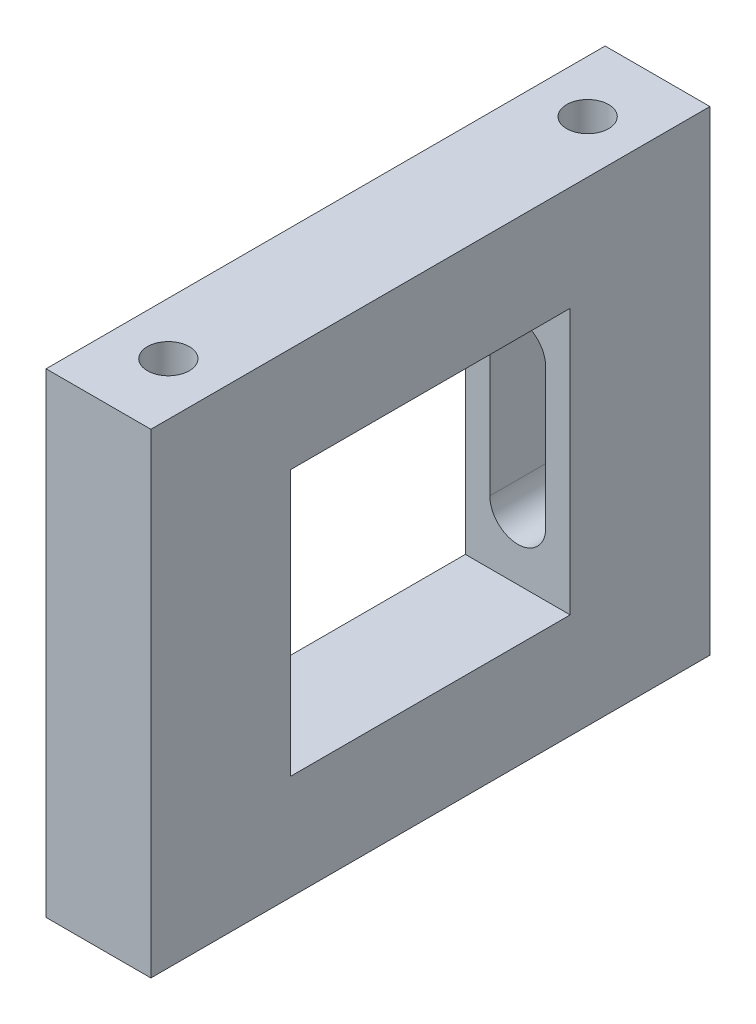
ISO-10303-21;
HEADER;
FILE_DESCRIPTION(('STEP AP214'),'2;1');
FILE_NAME('part.step','',(''),(''),'','','');
FILE_SCHEMA(('AUTOMOTIVE_DESIGN { 1 0 10303 214 1 1 1 1 }'));
ENDSEC;
DATA;
#1=APPLICATION_CONTEXT('core data for automotive mechanical design processes');
#2=APPLICATION_PROTOCOL_DEFINITION('international standard','automotive_design',2000,#1);
#3=PRODUCT_CONTEXT('',#1,'mechanical');
#4=PRODUCT('Part','Part','',(#3));
#5=PRODUCT_RELATED_PRODUCT_CATEGORY('part','',(#4));
#6=PRODUCT_DEFINITION_FORMATION('','',#4);
#7=PRODUCT_DEFINITION_CONTEXT('part definition',#1,'design');
#8=PRODUCT_DEFINITION('design','',#6,#7);
#9=PRODUCT_DEFINITION_SHAPE('','',#8);
#10=(LENGTH_UNIT() NAMED_UNIT(*) SI_UNIT(.MILLI.,.METRE.));
#11=(NAMED_UNIT(*) PLANE_ANGLE_UNIT() SI_UNIT($,.RADIAN.));
#12=(NAMED_UNIT(*) SI_UNIT($,.STERADIAN.) SOLID_ANGLE_UNIT());
#13=UNCERTAINTY_MEASURE_WITH_UNIT(LENGTH_MEASURE(1.E-05),#10,'distance_accuracy_value','');
#14=(GEOMETRIC_REPRESENTATION_CONTEXT(3) GLOBAL_UNCERTAINTY_ASSIGNED_CONTEXT((#13)) GLOBAL_UNIT_ASSIGNED_CONTEXT((#10,
#11,#12)) REPRESENTATION_CONTEXT('',''));
#15=CARTESIAN_POINT('',(0.,0.,0.));
#16=DIRECTION('',(0.,0.,1.));
#17=DIRECTION('',(1.,0.,0.));
#18=AXIS2_PLACEMENT_3D('',#15,#16,#17);
#19=CARTESIAN_POINT('',(-67.5,60.5,20.));
#20=DIRECTION('',(0.,0.,-1.));
#21=DIRECTION('',(-1.,0.,0.));
#22=AXIS2_PLACEMENT_3D('',#19,#20,#21);
#23=PLANE('',#22);
#24=DIRECTION('',(0.,-1.,0.));
#25=VECTOR('',#24,1.);
#26=CARTESIAN_POINT('',(-64.,36.5,20.));
#27=LINE('',#26,#25);
#28=CARTESIAN_POINT('',(-64.,36.5,20.));
#29=VERTEX_POINT('',#28);
#30=CARTESIAN_POINT('',(-64.,16.5,20.));
#31=VERTEX_POINT('',#30);
#32=EDGE_CURVE('E418',#29,#31,#27,.T.);
#33=ORIENTED_EDGE('',*,*,#32,.F.);
#34=CARTESIAN_POINT('',(-60.,36.5,20.));
#35=DIRECTION('',(0.,0.,1.));
#36=DIRECTION('',(1.,0.,0.));
#37=AXIS2_PLACEMENT_3D('',#34,#35,#36);
#38=CIRCLE('',#37,3.99999999999998);
#39=CARTESIAN_POINT('',(-56.,36.5,20.));
#40=VERTEX_POINT('',#39);
#41=EDGE_CURVE('E58',#40,#29,#38,.T.);
#42=ORIENTED_EDGE('',*,*,#41,.F.);
#43=DIRECTION('',(0.,1.,0.));
#44=VECTOR('',#43,1.);
#45=CARTESIAN_POINT('',(-56.,36.5,20.));
#46=LINE('',#45,#44);
#47=CARTESIAN_POINT('',(-56.,16.5,20.));
#48=VERTEX_POINT('',#47);
#49=EDGE_CURVE('E433',#48,#40,#46,.T.);
#50=ORIENTED_EDGE('',*,*,#49,.F.);
#51=CARTESIAN_POINT('',(-60.,16.5,20.));
#52=DIRECTION('',(0.,0.,1.));
#53=DIRECTION('',(1.,0.,0.));
#54=AXIS2_PLACEMENT_3D('',#51,#52,#53);
#55=CIRCLE('',#54,4.);
#56=EDGE_CURVE('E443',#31,#48,#55,.T.);
#57=ORIENTED_EDGE('',*,*,#56,.F.);
#58=EDGE_LOOP('',(#33,#42,#50,#57));
#59=FACE_BOUND('',#58,.T.);
#60=DIRECTION('',(1.,0.,0.));
#61=VECTOR('',#60,1.);
#62=CARTESIAN_POINT('',(-67.5,45.5,20.));
#63=LINE('',#62,#61);
#64=CARTESIAN_POINT('',(-67.5,45.5,20.));
#65=VERTEX_POINT('',#64);
#66=CARTESIAN_POINT('',(-52.5,45.5,20.));
#67=VERTEX_POINT('',#66);
#68=EDGE_CURVE('E133',#65,#67,#63,.T.);
#69=ORIENTED_EDGE('',*,*,#68,.F.);
#70=DIRECTION('',(0.,-1.,0.));
#71=VECTOR('',#70,1.);
#72=CARTESIAN_POINT('',(-67.5,60.5,20.));
#73=LINE('',#72,#71);
#74=CARTESIAN_POINT('',(-67.5,7.5,20.));
#75=VERTEX_POINT('',#74);
#76=EDGE_CURVE('E36',#65,#75,#73,.T.);
#77=ORIENTED_EDGE('',*,*,#76,.T.);
#78=DIRECTION('',(1.,0.,0.));
#79=VECTOR('',#78,1.);
#80=CARTESIAN_POINT('',(-67.5,7.49999999999999,20.));
#81=LINE('',#80,#79);
#82=CARTESIAN_POINT('',(-52.5,7.5,20.));
#83=VERTEX_POINT('',#82);
#84=EDGE_CURVE('E150',#75,#83,#81,.T.);
#85=ORIENTED_EDGE('',*,*,#84,.T.);
#86=DIRECTION('',(0.,-1.,0.));
#87=VECTOR('',#86,1.);
#88=CARTESIAN_POINT('',(-52.5,60.5,20.));
#89=LINE('',#88,#87);
#90=EDGE_CURVE('E164',#67,#83,#89,.T.);
#91=ORIENTED_EDGE('',*,*,#90,.F.);
#92=EDGE_LOOP('',(#69,#77,#85,#91));
#93=FACE_BOUND('',#92,.T.);
#94=ADVANCED_FACE('F32',(#59,#93),#23,.F.);
#95=CARTESIAN_POINT('',(-67.5,60.5,60.));
#96=DIRECTION('',(0.,0.,1.));
#97=DIRECTION('',(1.,0.,0.));
#98=AXIS2_PLACEMENT_3D('',#95,#96,#97);
#99=PLANE('',#98);
#100=DIRECTION('',(1.,0.,0.));
#101=VECTOR('',#100,1.);
#102=CARTESIAN_POINT('',(-67.5,45.5,60.));
#103=LINE('',#102,#101);
#104=CARTESIAN_POINT('',(-67.5,45.5,60.));
#105=VERTEX_POINT('',#104);
#106=CARTESIAN_POINT('',(-52.5,45.5,60.));
#107=VERTEX_POINT('',#106);
#108=EDGE_CURVE('E123',#105,#107,#103,.T.);
#109=ORIENTED_EDGE('',*,*,#108,.T.);
#110=DIRECTION('',(0.,-1.,0.));
#111=VECTOR('',#110,1.);
#112=CARTESIAN_POINT('',(-52.5,60.5,60.));
#113=LINE('',#112,#111);
#114=CARTESIAN_POINT('',(-52.5,7.5,60.));
#115=VERTEX_POINT('',#114);
#116=EDGE_CURVE('E147',#107,#115,#113,.T.);
#117=ORIENTED_EDGE('',*,*,#116,.T.);
#118=DIRECTION('',(-1.,0.,0.));
#119=VECTOR('',#118,1.);
#120=CARTESIAN_POINT('',(-67.5,7.49999999999999,60.));
#121=LINE('',#120,#119);
#122=CARTESIAN_POINT('',(-67.5,7.49999999999999,60.));
#123=VERTEX_POINT('',#122);
#124=EDGE_CURVE('E145',#115,#123,#121,.T.);
#125=ORIENTED_EDGE('',*,*,#124,.T.);
#126=DIRECTION('',(0.,-1.,0.));
#127=VECTOR('',#126,1.);
#128=CARTESIAN_POINT('',(-67.5,60.5,60.));
#129=LINE('',#128,#127);
#130=EDGE_CURVE('E139',#105,#123,#129,.T.);
#131=ORIENTED_EDGE('',*,*,#130,.F.);
#132=EDGE_LOOP('',(#109,#117,#125,#131));
#133=FACE_BOUND('',#132,.T.);
#134=ADVANCED_FACE('F143',(#133),#99,.F.);
#135=CARTESIAN_POINT('',(-52.5,7.5,80.));
#136=DIRECTION('',(0.,-1.,0.));
#137=DIRECTION('',(1.,0.,0.));
#138=AXIS2_PLACEMENT_3D('',#135,#136,#137);
#139=PLANE('',#138);
#140=ORIENTED_EDGE('',*,*,#124,.F.);
#141=DIRECTION('',(0.,0.,-1.));
#142=VECTOR('',#141,1.);
#143=CARTESIAN_POINT('',(-52.5,7.5,80.));
#144=LINE('',#143,#142);
#145=EDGE_CURVE('E179',#115,#83,#144,.T.);
#146=ORIENTED_EDGE('',*,*,#145,.T.);
#147=ORIENTED_EDGE('',*,*,#84,.F.);
#148=DIRECTION('',(0.,0.,-1.));
#149=VECTOR('',#148,1.);
#150=CARTESIAN_POINT('',(-67.5,7.5,80.));
#151=LINE('',#150,#149);
#152=EDGE_CURVE('E177',#123,#75,#151,.T.);
#153=ORIENTED_EDGE('',*,*,#152,.F.);
#154=EDGE_LOOP('',(#140,#146,#147,#153));
#155=FACE_BOUND('',#154,.T.);
#156=ADVANCED_FACE('F196',(#155),#139,.F.);
#157=CARTESIAN_POINT('',(-67.5,-7.5,80.));
#158=DIRECTION('',(1.,0.,0.));
#159=DIRECTION('',(0.,0.,-1.));
#160=AXIS2_PLACEMENT_3D('',#157,#158,#159);
#161=PLANE('',#160);
#162=ORIENTED_EDGE('',*,*,#76,.F.);
#163=DIRECTION('',(0.,0.,-1.));
#164=VECTOR('',#163,1.);
#165=CARTESIAN_POINT('',(-67.5,45.5,60.));
#166=LINE('',#165,#164);
#167=EDGE_CURVE('E126',#105,#65,#166,.T.);
#168=ORIENTED_EDGE('',*,*,#167,.F.);
#169=ORIENTED_EDGE('',*,*,#130,.T.);
#170=ORIENTED_EDGE('',*,*,#152,.T.);
#171=EDGE_LOOP('',(#162,#168,#169,#170));
#172=FACE_BOUND('',#171,.T.);
#173=DIRECTION('',(0.,-1.,0.));
#174=VECTOR('',#173,1.);
#175=CARTESIAN_POINT('',(-67.5,-7.5,0.));
#176=LINE('',#175,#174);
#177=CARTESIAN_POINT('',(-67.5,60.5,0.));
#178=VERTEX_POINT('',#177);
#179=CARTESIAN_POINT('',(-67.5,-7.5,0.));
#180=VERTEX_POINT('',#179);
#181=EDGE_CURVE('E200',#178,#180,#176,.T.);
#182=ORIENTED_EDGE('',*,*,#181,.T.);
#183=DIRECTION('',(0.,0.,-1.));
#184=VECTOR('',#183,1.);
#185=CARTESIAN_POINT('',(-67.5,-7.5,80.));
#186=LINE('',#185,#184);
#187=CARTESIAN_POINT('',(-67.5,-7.5,80.));
#188=VERTEX_POINT('',#187);
#189=EDGE_CURVE('E11',#188,#180,#186,.T.);
#190=ORIENTED_EDGE('',*,*,#189,.F.);
#191=DIRECTION('',(0.,-1.,0.));
#192=VECTOR('',#191,1.);
#193=CARTESIAN_POINT('',(-67.5,-7.5,80.));
#194=LINE('',#193,#192);
#195=CARTESIAN_POINT('',(-67.5,60.5,80.));
#196=VERTEX_POINT('',#195);
#197=EDGE_CURVE('E167',#196,#188,#194,.T.);
#198=ORIENTED_EDGE('',*,*,#197,.F.);
#199=DIRECTION('',(0.,0.,1.));
#200=VECTOR('',#199,1.);
#201=CARTESIAN_POINT('',(-67.5,60.5,0.));
#202=LINE('',#201,#200);
#203=EDGE_CURVE('E156',#178,#196,#202,.T.);
#204=ORIENTED_EDGE('',*,*,#203,.F.);
#205=EDGE_LOOP('',(#182,#190,#198,#204));
#206=FACE_BOUND('',#205,.T.);
#207=ADVANCED_FACE('F34',(#172,#206),#161,.F.);
#208=CARTESIAN_POINT('',(-52.5,-7.5,80.));
#209=DIRECTION('',(0.,1.,0.));
#210=DIRECTION('',(-1.,0.,0.));
#211=AXIS2_PLACEMENT_3D('',#208,#209,#210);
#212=PLANE('',#211);
#213=DIRECTION('',(1.,0.,0.));
#214=VECTOR('',#213,1.);
#215=CARTESIAN_POINT('',(-52.5,-7.5,0.));
#216=LINE('',#215,#214);
#217=CARTESIAN_POINT('',(-52.5,-7.5,0.));
#218=VERTEX_POINT('',#217);
#219=EDGE_CURVE('E202',#180,#218,#216,.T.);
#220=ORIENTED_EDGE('',*,*,#219,.T.);
#221=DIRECTION('',(0.,0.,-1.));
#222=VECTOR('',#221,1.);
#223=CARTESIAN_POINT('',(-52.5,-7.5,80.));
#224=LINE('',#223,#222);
#225=CARTESIAN_POINT('',(-52.5,-7.5,80.));
#226=VERTEX_POINT('',#225);
#227=EDGE_CURVE('E42',#226,#218,#224,.T.);
#228=ORIENTED_EDGE('',*,*,#227,.F.);
#229=DIRECTION('',(1.,0.,0.));
#230=VECTOR('',#229,1.);
#231=CARTESIAN_POINT('',(-52.5,-7.5,80.));
#232=LINE('',#231,#230);
#233=EDGE_CURVE('E208',#188,#226,#232,.T.);
#234=ORIENTED_EDGE('',*,*,#233,.F.);
#235=ORIENTED_EDGE('',*,*,#189,.T.);
#236=EDGE_LOOP('',(#220,#228,#234,#235));
#237=FACE_BOUND('',#236,.T.);
#238=ADVANCED_FACE('F221',(#237),#212,.F.);
#239=CARTESIAN_POINT('',(-52.5,-7.5,80.));
#240=DIRECTION('',(-1.,0.,0.));
#241=DIRECTION('',(0.,0.,1.));
#242=AXIS2_PLACEMENT_3D('',#239,#240,#241);
#243=PLANE('',#242);
#244=DIRECTION('',(0.,0.,-1.));
#245=VECTOR('',#244,1.);
#246=CARTESIAN_POINT('',(-52.5,45.5,60.));
#247=LINE('',#246,#245);
#248=EDGE_CURVE('E129',#107,#67,#247,.T.);
#249=ORIENTED_EDGE('',*,*,#248,.T.);
#250=ORIENTED_EDGE('',*,*,#90,.T.);
#251=ORIENTED_EDGE('',*,*,#145,.F.);
#252=ORIENTED_EDGE('',*,*,#116,.F.);
#253=EDGE_LOOP('',(#249,#250,#251,#252));
#254=FACE_BOUND('',#253,.T.);
#255=DIRECTION('',(0.,1.,0.));
#256=VECTOR('',#255,1.);
#257=CARTESIAN_POINT('',(-52.5,-7.5,0.));
#258=LINE('',#257,#256);
#259=CARTESIAN_POINT('',(-52.5,60.5,0.));
#260=VERTEX_POINT('',#259);
#261=EDGE_CURVE('E184',#218,#260,#258,.T.);
#262=ORIENTED_EDGE('',*,*,#261,.T.);
#263=DIRECTION('',(0.,0.,-1.));
#264=VECTOR('',#263,1.);
#265=CARTESIAN_POINT('',(-52.5,60.5,0.));
#266=LINE('',#265,#264);
#267=CARTESIAN_POINT('',(-52.5,60.5,80.));
#268=VERTEX_POINT('',#267);
#269=EDGE_CURVE('E158',#268,#260,#266,.T.);
#270=ORIENTED_EDGE('',*,*,#269,.F.);
#271=DIRECTION('',(0.,1.,0.));
#272=VECTOR('',#271,1.);
#273=CARTESIAN_POINT('',(-52.5,-7.5,80.));
#274=LINE('',#273,#272);
#275=EDGE_CURVE('E180',#226,#268,#274,.T.);
#276=ORIENTED_EDGE('',*,*,#275,.F.);
#277=ORIENTED_EDGE('',*,*,#227,.T.);
#278=EDGE_LOOP('',(#262,#270,#276,#277));
#279=FACE_BOUND('',#278,.T.);
#280=ADVANCED_FACE('F213',(#254,#279),#243,.F.);
#281=CARTESIAN_POINT('',(0.,0.,80.));
#282=DIRECTION('',(0.,0.,1.));
#283=DIRECTION('',(1.,0.,0.));
#284=AXIS2_PLACEMENT_3D('',#281,#282,#283);
#285=PLANE('',#284);
#286=ORIENTED_EDGE('',*,*,#197,.T.);
#287=ORIENTED_EDGE('',*,*,#233,.T.);
#288=ORIENTED_EDGE('',*,*,#275,.T.);
#289=DIRECTION('',(1.,0.,0.));
#290=VECTOR('',#289,1.);
#291=CARTESIAN_POINT('',(-67.5,60.5,80.));
#292=LINE('',#291,#290);
#293=EDGE_CURVE('E148',#196,#268,#292,.T.);
#294=ORIENTED_EDGE('',*,*,#293,.F.);
#295=EDGE_LOOP('',(#286,#287,#288,#294));
#296=FACE_BOUND('',#295,.T.);
#297=ADVANCED_FACE('F222',(#296),#285,.T.);
#298=CARTESIAN_POINT('',(0.,0.,0.));
#299=DIRECTION('',(0.,0.,1.));
#300=DIRECTION('',(1.,0.,0.));
#301=AXIS2_PLACEMENT_3D('',#298,#299,#300);
#302=PLANE('',#301);
#303=DIRECTION('',(0.,1.,0.));
#304=VECTOR('',#303,1.);
#305=CARTESIAN_POINT('',(-56.,36.5,0.));
#306=LINE('',#305,#304);
#307=CARTESIAN_POINT('',(-56.,16.5,0.));
#308=VERTEX_POINT('',#307);
#309=CARTESIAN_POINT('',(-56.,36.5,0.));
#310=VERTEX_POINT('',#309);
#311=EDGE_CURVE('E437',#308,#310,#306,.T.);
#312=ORIENTED_EDGE('',*,*,#311,.T.);
#313=CARTESIAN_POINT('',(-60.,36.5,0.));
#314=DIRECTION('',(0.,0.,1.));
#315=DIRECTION('',(1.,0.,0.));
#316=AXIS2_PLACEMENT_3D('',#313,#314,#315);
#317=CIRCLE('',#316,3.99999999999998);
#318=CARTESIAN_POINT('',(-64.,36.5,0.));
#319=VERTEX_POINT('',#318);
#320=EDGE_CURVE('E429',#310,#319,#317,.T.);
#321=ORIENTED_EDGE('',*,*,#320,.T.);
#322=DIRECTION('',(0.,-1.,0.));
#323=VECTOR('',#322,1.);
#324=CARTESIAN_POINT('',(-64.,36.5,0.));
#325=LINE('',#324,#323);
#326=CARTESIAN_POINT('',(-64.,16.5,0.));
#327=VERTEX_POINT('',#326);
#328=EDGE_CURVE('E432',#319,#327,#325,.T.);
#329=ORIENTED_EDGE('',*,*,#328,.T.);
#330=CARTESIAN_POINT('',(-60.,16.5,0.));
#331=DIRECTION('',(0.,0.,1.));
#332=DIRECTION('',(1.,0.,0.));
#333=AXIS2_PLACEMENT_3D('',#330,#331,#332);
#334=CIRCLE('',#333,4.);
#335=EDGE_CURVE('E50',#327,#308,#334,.T.);
#336=ORIENTED_EDGE('',*,*,#335,.T.);
#337=EDGE_LOOP('',(#312,#321,#329,#336));
#338=FACE_BOUND('',#337,.T.);
#339=ORIENTED_EDGE('',*,*,#181,.F.);
#340=DIRECTION('',(-1.,0.,0.));
#341=VECTOR('',#340,1.);
#342=CARTESIAN_POINT('',(-67.5,60.5,0.));
#343=LINE('',#342,#341);
#344=EDGE_CURVE('E161',#260,#178,#343,.T.);
#345=ORIENTED_EDGE('',*,*,#344,.F.);
#346=ORIENTED_EDGE('',*,*,#261,.F.);
#347=ORIENTED_EDGE('',*,*,#219,.F.);
#348=EDGE_LOOP('',(#339,#345,#346,#347));
#349=FACE_BOUND('',#348,.T.);
#350=ADVANCED_FACE('F219',(#338,#349),#302,.F.);
#351=CARTESIAN_POINT('',(0.,60.5,0.));
#352=DIRECTION('',(0.,1.,0.));
#353=DIRECTION('',(-1.,0.,0.));
#354=AXIS2_PLACEMENT_3D('',#351,#352,#353);
#355=PLANE('',#354);
#356=CARTESIAN_POINT('',(-60.,60.5,10.));
#357=DIRECTION('',(0.,1.,0.));
#358=DIRECTION('',(-1.,0.,0.));
#359=AXIS2_PLACEMENT_3D('',#356,#357,#358);
#360=CIRCLE('',#359,3.);
#361=CARTESIAN_POINT('',(-63.,60.5,10.));
#362=VERTEX_POINT('',#361);
#363=EDGE_CURVE('E416',#362,#362,#360,.T.);
#364=ORIENTED_EDGE('',*,*,#363,.F.);
#365=EDGE_LOOP('',(#364));
#366=FACE_BOUND('',#365,.T.);
#367=ORIENTED_EDGE('',*,*,#203,.T.);
#368=ORIENTED_EDGE('',*,*,#293,.T.);
#369=ORIENTED_EDGE('',*,*,#269,.T.);
#370=ORIENTED_EDGE('',*,*,#344,.T.);
#371=EDGE_LOOP('',(#367,#368,#369,#370));
#372=FACE_BOUND('',#371,.T.);
#373=CARTESIAN_POINT('',(-60.,60.5,70.));
#374=DIRECTION('',(0.,1.,0.));
#375=DIRECTION('',(1.,0.,0.));
#376=AXIS2_PLACEMENT_3D('',#373,#374,#375);
#377=CIRCLE('',#376,3.);
#378=CARTESIAN_POINT('',(-57.,60.5,70.));
#379=VERTEX_POINT('',#378);
#380=EDGE_CURVE('E141',#379,#379,#377,.T.);
#381=ORIENTED_EDGE('',*,*,#380,.F.);
#382=EDGE_LOOP('',(#381));
#383=FACE_BOUND('',#382,.T.);
#384=ADVANCED_FACE('F217',(#366,#372,#383),#355,.T.);
#385=CARTESIAN_POINT('',(-60.,36.5,0.));
#386=DIRECTION('',(0.,0.,1.));
#387=DIRECTION('',(1.,0.,0.));
#388=AXIS2_PLACEMENT_3D('',#385,#386,#387);
#389=CYLINDRICAL_SURFACE('',#388,3.99999999999998);
#390=ORIENTED_EDGE('',*,*,#41,.T.);
#391=DIRECTION('',(0.,0.,1.));
#392=VECTOR('',#391,1.);
#393=CARTESIAN_POINT('',(-64.,36.5,0.));
#394=LINE('',#393,#392);
#395=EDGE_CURVE('E439',#319,#29,#394,.T.);
#396=ORIENTED_EDGE('',*,*,#395,.F.);
#397=ORIENTED_EDGE('',*,*,#320,.F.);
#398=DIRECTION('',(0.,0.,1.));
#399=VECTOR('',#398,1.);
#400=CARTESIAN_POINT('',(-56.,36.5,0.));
#401=LINE('',#400,#399);
#402=EDGE_CURVE('E448',#310,#40,#401,.T.);
#403=ORIENTED_EDGE('',*,*,#402,.T.);
#404=EDGE_LOOP('',(#390,#396,#397,#403));
#405=FACE_BOUND('',#404,.T.);
#406=ADVANCED_FACE('F242',(#405),#389,.F.);
#407=CARTESIAN_POINT('',(-56.,36.5,0.));
#408=DIRECTION('',(1.,0.,0.));
#409=DIRECTION('',(0.,1.,0.));
#410=AXIS2_PLACEMENT_3D('',#407,#408,#409);
#411=PLANE('',#410);
#412=ORIENTED_EDGE('',*,*,#49,.T.);
#413=ORIENTED_EDGE('',*,*,#402,.F.);
#414=ORIENTED_EDGE('',*,*,#311,.F.);
#415=DIRECTION('',(0.,0.,1.));
#416=VECTOR('',#415,1.);
#417=CARTESIAN_POINT('',(-56.,16.5,0.));
#418=LINE('',#417,#416);
#419=EDGE_CURVE('E450',#308,#48,#418,.T.);
#420=ORIENTED_EDGE('',*,*,#419,.T.);
#421=EDGE_LOOP('',(#412,#413,#414,#420));
#422=FACE_BOUND('',#421,.T.);
#423=ADVANCED_FACE('F247',(#422),#411,.F.);
#424=CARTESIAN_POINT('',(-60.,16.5,0.));
#425=DIRECTION('',(0.,0.,1.));
#426=DIRECTION('',(1.,0.,0.));
#427=AXIS2_PLACEMENT_3D('',#424,#425,#426);
#428=CYLINDRICAL_SURFACE('',#427,4.);
#429=ORIENTED_EDGE('',*,*,#56,.T.);
#430=ORIENTED_EDGE('',*,*,#419,.F.);
#431=ORIENTED_EDGE('',*,*,#335,.F.);
#432=DIRECTION('',(0.,0.,1.));
#433=VECTOR('',#432,1.);
#434=CARTESIAN_POINT('',(-64.,16.5,0.));
#435=LINE('',#434,#433);
#436=EDGE_CURVE('E452',#327,#31,#435,.T.);
#437=ORIENTED_EDGE('',*,*,#436,.T.);
#438=EDGE_LOOP('',(#429,#430,#431,#437));
#439=FACE_BOUND('',#438,.T.);
#440=ADVANCED_FACE('F252',(#439),#428,.F.);
#441=CARTESIAN_POINT('',(-64.,36.5,0.));
#442=DIRECTION('',(-1.,0.,0.));
#443=DIRECTION('',(0.,-1.,0.));
#444=AXIS2_PLACEMENT_3D('',#441,#442,#443);
#445=PLANE('',#444);
#446=ORIENTED_EDGE('',*,*,#32,.T.);
#447=ORIENTED_EDGE('',*,*,#436,.F.);
#448=ORIENTED_EDGE('',*,*,#328,.F.);
#449=ORIENTED_EDGE('',*,*,#395,.T.);
#450=EDGE_LOOP('',(#446,#447,#448,#449));
#451=FACE_BOUND('',#450,.T.);
#452=ADVANCED_FACE('F248',(#451),#445,.F.);
#453=CARTESIAN_POINT('',(-60.,44.,70.));
#454=DIRECTION('',(0.,1.,0.));
#455=DIRECTION('',(-1.,0.,0.));
#456=AXIS2_PLACEMENT_3D('',#453,#454,#455);
#457=CYLINDRICAL_SURFACE('',#456,3.);
#458=CARTESIAN_POINT('',(-60.,44.,70.));
#459=DIRECTION('',(0.,1.,0.));
#460=DIRECTION('',(1.,0.,0.));
#461=AXIS2_PLACEMENT_3D('',#458,#459,#460);
#462=CIRCLE('',#461,3.);
#463=CARTESIAN_POINT('',(-57.,44.,70.));
#464=VERTEX_POINT('',#463);
#465=EDGE_CURVE('E421',#464,#464,#462,.T.);
#466=ORIENTED_EDGE('',*,*,#465,.F.);
#467=EDGE_LOOP('',(#466));
#468=FACE_BOUND('',#467,.T.);
#469=ORIENTED_EDGE('',*,*,#380,.T.);
#470=EDGE_LOOP('',(#469));
#471=FACE_BOUND('',#470,.T.);
#472=ADVANCED_FACE('F251',(#468,#471),#457,.F.);
#473=CARTESIAN_POINT('',(-60.,44.,70.));
#474=DIRECTION('',(0.,-1.,0.));
#475=DIRECTION('',(1.,0.,0.));
#476=AXIS2_PLACEMENT_3D('',#473,#474,#475);
#477=PLANE('',#476);
#478=ORIENTED_EDGE('',*,*,#465,.T.);
#479=EDGE_LOOP('',(#478));
#480=FACE_BOUND('',#479,.T.);
#481=ADVANCED_FACE('F261',(#480),#477,.F.);
#482=CARTESIAN_POINT('',(-60.,44.,10.));
#483=DIRECTION('',(0.,1.,0.));
#484=DIRECTION('',(-1.,0.,0.));
#485=AXIS2_PLACEMENT_3D('',#482,#483,#484);
#486=CYLINDRICAL_SURFACE('',#485,3.);
#487=CARTESIAN_POINT('',(-60.,44.,10.));
#488=DIRECTION('',(0.,1.,0.));
#489=DIRECTION('',(-1.,0.,0.));
#490=AXIS2_PLACEMENT_3D('',#487,#488,#489);
#491=CIRCLE('',#490,3.);
#492=CARTESIAN_POINT('',(-63.,44.,10.));
#493=VERTEX_POINT('',#492);
#494=EDGE_CURVE('E415',#493,#493,#491,.T.);
#495=ORIENTED_EDGE('',*,*,#494,.F.);
#496=EDGE_LOOP('',(#495));
#497=FACE_BOUND('',#496,.T.);
#498=ORIENTED_EDGE('',*,*,#363,.T.);
#499=EDGE_LOOP('',(#498));
#500=FACE_BOUND('',#499,.T.);
#501=ADVANCED_FACE('F265',(#497,#500),#486,.F.);
#502=CARTESIAN_POINT('',(-60.,44.,10.));
#503=DIRECTION('',(0.,1.,0.));
#504=DIRECTION('',(-1.,0.,0.));
#505=AXIS2_PLACEMENT_3D('',#502,#503,#504);
#506=PLANE('',#505);
#507=ORIENTED_EDGE('',*,*,#494,.T.);
#508=EDGE_LOOP('',(#507));
#509=FACE_BOUND('',#508,.T.);
#510=ADVANCED_FACE('F269',(#509),#506,.T.);
#511=CARTESIAN_POINT('',(-67.5,45.5,60.));
#512=DIRECTION('',(0.,1.,0.));
#513=DIRECTION('',(0.,0.,1.));
#514=AXIS2_PLACEMENT_3D('',#511,#512,#513);
#515=PLANE('',#514);
#516=ORIENTED_EDGE('',*,*,#68,.T.);
#517=ORIENTED_EDGE('',*,*,#248,.F.);
#518=ORIENTED_EDGE('',*,*,#108,.F.);
#519=ORIENTED_EDGE('',*,*,#167,.T.);
#520=EDGE_LOOP('',(#516,#517,#518,#519));
#521=FACE_BOUND('',#520,.T.);
#522=ADVANCED_FACE('F125',(#521),#515,.F.);
#523=CLOSED_SHELL('',(#94,#134,#156,#207,#238,#280,#297,#350,#384,#406,#423,#440,#452,#472,#481,
#501,#510,#522));
#524=MANIFOLD_SOLID_BREP('B2',#523);
#525=ADVANCED_BREP_SHAPE_REPRESENTATION('',(#18,#524),#14);
#526=SHAPE_DEFINITION_REPRESENTATION(#9,#525);
ENDSEC;
END-ISO-10303-21;
